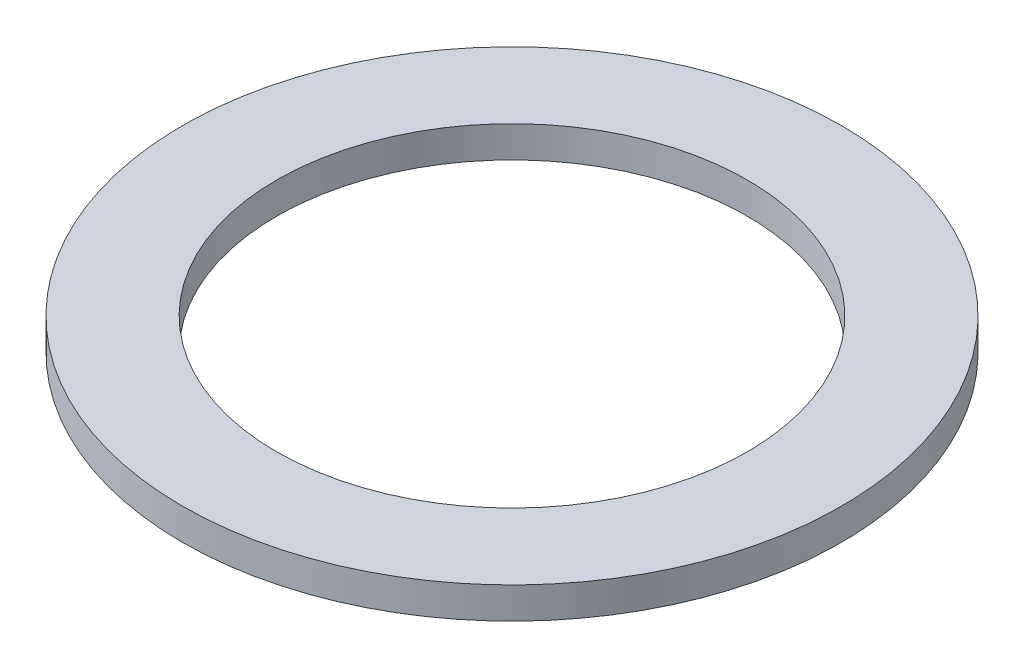
ISO-10303-21;
HEADER;
FILE_DESCRIPTION(('STEP AP214'),'2;1');
FILE_NAME('part.step','',(''),(''),'','','');
FILE_SCHEMA(('AUTOMOTIVE_DESIGN { 1 0 10303 214 1 1 1 1 }'));
ENDSEC;
DATA;
#1=APPLICATION_CONTEXT('core data for automotive mechanical design processes');
#2=APPLICATION_PROTOCOL_DEFINITION('international standard','automotive_design',2000,#1);
#3=PRODUCT_CONTEXT('',#1,'mechanical');
#4=PRODUCT('Part','Part','',(#3));
#5=PRODUCT_RELATED_PRODUCT_CATEGORY('part','',(#4));
#6=PRODUCT_DEFINITION_FORMATION('','',#4);
#7=PRODUCT_DEFINITION_CONTEXT('part definition',#1,'design');
#8=PRODUCT_DEFINITION('design','',#6,#7);
#9=PRODUCT_DEFINITION_SHAPE('','',#8);
#10=(LENGTH_UNIT() NAMED_UNIT(*) SI_UNIT(.MILLI.,.METRE.));
#11=(NAMED_UNIT(*) PLANE_ANGLE_UNIT() SI_UNIT($,.RADIAN.));
#12=(NAMED_UNIT(*) SI_UNIT($,.STERADIAN.) SOLID_ANGLE_UNIT());
#13=UNCERTAINTY_MEASURE_WITH_UNIT(LENGTH_MEASURE(1.E-05),#10,'distance_accuracy_value','');
#14=(GEOMETRIC_REPRESENTATION_CONTEXT(3) GLOBAL_UNCERTAINTY_ASSIGNED_CONTEXT((#13)) GLOBAL_UNIT_ASSIGNED_CONTEXT((#10,
#11,#12)) REPRESENTATION_CONTEXT('',''));
#15=CARTESIAN_POINT('',(0.,0.,0.));
#16=DIRECTION('',(0.,0.,1.));
#17=DIRECTION('',(1.,0.,0.));
#18=AXIS2_PLACEMENT_3D('',#15,#16,#17);
#19=CARTESIAN_POINT('',(0.,5.,0.));
#20=DIRECTION('',(0.,-1.,0.));
#21=DIRECTION('',(0.,0.,-1.));
#22=AXIS2_PLACEMENT_3D('',#19,#20,#21);
#23=CYLINDRICAL_SURFACE('',#22,52.5);
#24=CARTESIAN_POINT('',(0.,5.,0.));
#25=DIRECTION('',(0.,1.,0.));
#26=DIRECTION('',(0.,0.,1.));
#27=AXIS2_PLACEMENT_3D('',#24,#25,#26);
#28=CIRCLE('',#27,52.5);
#29=CARTESIAN_POINT('',(0.,5.,52.5));
#30=VERTEX_POINT('',#29);
#31=EDGE_CURVE('E10',#30,#30,#28,.T.);
#32=ORIENTED_EDGE('',*,*,#31,.F.);
#33=EDGE_LOOP('',(#32));
#34=FACE_BOUND('',#33,.T.);
#35=CARTESIAN_POINT('',(0.,0.,0.));
#36=DIRECTION('',(0.,1.,0.));
#37=DIRECTION('',(0.,0.,1.));
#38=AXIS2_PLACEMENT_3D('',#35,#36,#37);
#39=CIRCLE('',#38,52.5);
#40=CARTESIAN_POINT('',(0.,0.,52.5));
#41=VERTEX_POINT('',#40);
#42=EDGE_CURVE('E37',#41,#41,#39,.T.);
#43=ORIENTED_EDGE('',*,*,#42,.T.);
#44=EDGE_LOOP('',(#43));
#45=FACE_BOUND('',#44,.T.);
#46=ADVANCED_FACE('F40',(#34,#45),#23,.T.);
#47=CARTESIAN_POINT('',(0.,5.,0.));
#48=DIRECTION('',(0.,1.,0.));
#49=DIRECTION('',(0.,0.,1.));
#50=AXIS2_PLACEMENT_3D('',#47,#48,#49);
#51=PLANE('',#50);
#52=CARTESIAN_POINT('',(0.,5.,0.));
#53=DIRECTION('',(0.,1.,0.));
#54=DIRECTION('',(0.,0.,1.));
#55=AXIS2_PLACEMENT_3D('',#52,#53,#54);
#56=CIRCLE('',#55,37.5);
#57=CARTESIAN_POINT('',(0.,5.,37.5));
#58=VERTEX_POINT('',#57);
#59=EDGE_CURVE('E50',#58,#58,#56,.T.);
#60=ORIENTED_EDGE('',*,*,#59,.F.);
#61=EDGE_LOOP('',(#60));
#62=FACE_BOUND('',#61,.T.);
#63=ORIENTED_EDGE('',*,*,#31,.T.);
#64=EDGE_LOOP('',(#63));
#65=FACE_BOUND('',#64,.T.);
#66=ADVANCED_FACE('F59',(#62,#65),#51,.T.);
#67=CARTESIAN_POINT('',(0.,0.,0.));
#68=DIRECTION('',(0.,1.,0.));
#69=DIRECTION('',(0.,0.,1.));
#70=AXIS2_PLACEMENT_3D('',#67,#68,#69);
#71=PLANE('',#70);
#72=CARTESIAN_POINT('',(0.,0.,0.));
#73=DIRECTION('',(0.,1.,0.));
#74=DIRECTION('',(0.,0.,1.));
#75=AXIS2_PLACEMENT_3D('',#72,#73,#74);
#76=CIRCLE('',#75,37.5);
#77=CARTESIAN_POINT('',(0.,0.,37.5));
#78=VERTEX_POINT('',#77);
#79=EDGE_CURVE('E47',#78,#78,#76,.T.);
#80=ORIENTED_EDGE('',*,*,#79,.T.);
#81=EDGE_LOOP('',(#80));
#82=FACE_BOUND('',#81,.T.);
#83=ORIENTED_EDGE('',*,*,#42,.F.);
#84=EDGE_LOOP('',(#83));
#85=FACE_BOUND('',#84,.T.);
#86=ADVANCED_FACE('F58',(#82,#85),#71,.F.);
#87=CARTESIAN_POINT('',(0.,5.,0.));
#88=DIRECTION('',(0.,-1.,0.));
#89=DIRECTION('',(0.,0.,-1.));
#90=AXIS2_PLACEMENT_3D('',#87,#88,#89);
#91=CYLINDRICAL_SURFACE('',#90,37.5);
#92=ORIENTED_EDGE('',*,*,#59,.T.);
#93=EDGE_LOOP('',(#92));
#94=FACE_BOUND('',#93,.T.);
#95=ORIENTED_EDGE('',*,*,#79,.F.);
#96=EDGE_LOOP('',(#95));
#97=FACE_BOUND('',#96,.T.);
#98=ADVANCED_FACE('F54',(#94,#97),#91,.F.);
#99=CLOSED_SHELL('',(#46,#66,#86,#98));
#100=MANIFOLD_SOLID_BREP('B2',#99);
#101=ADVANCED_BREP_SHAPE_REPRESENTATION('',(#18,#100),#14);
#102=SHAPE_DEFINITION_REPRESENTATION(#9,#101);
ENDSEC;
END-ISO-10303-21;
